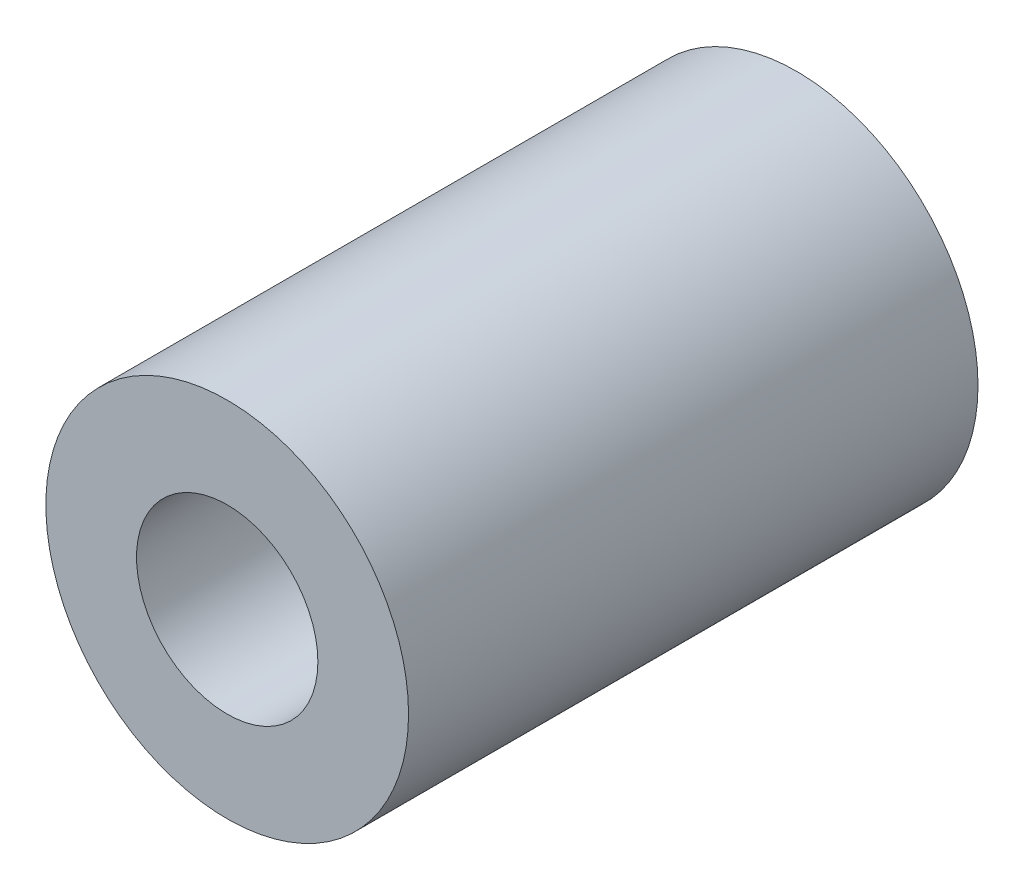
ISO-10303-21;
HEADER;
FILE_DESCRIPTION(('STEP AP214'),'2;1');
FILE_NAME('part.step','',(''),(''),'','','');
FILE_SCHEMA(('AUTOMOTIVE_DESIGN { 1 0 10303 214 1 1 1 1 }'));
ENDSEC;
DATA;
#1=APPLICATION_CONTEXT('core data for automotive mechanical design processes');
#2=APPLICATION_PROTOCOL_DEFINITION('international standard','automotive_design',2000,#1);
#3=PRODUCT_CONTEXT('',#1,'mechanical');
#4=PRODUCT('Part','Part','',(#3));
#5=PRODUCT_RELATED_PRODUCT_CATEGORY('part','',(#4));
#6=PRODUCT_DEFINITION_FORMATION('','',#4);
#7=PRODUCT_DEFINITION_CONTEXT('part definition',#1,'design');
#8=PRODUCT_DEFINITION('design','',#6,#7);
#9=PRODUCT_DEFINITION_SHAPE('','',#8);
#10=(LENGTH_UNIT() NAMED_UNIT(*) SI_UNIT(.MILLI.,.METRE.));
#11=(NAMED_UNIT(*) PLANE_ANGLE_UNIT() SI_UNIT($,.RADIAN.));
#12=(NAMED_UNIT(*) SI_UNIT($,.STERADIAN.) SOLID_ANGLE_UNIT());
#13=UNCERTAINTY_MEASURE_WITH_UNIT(LENGTH_MEASURE(1.E-05),#10,'distance_accuracy_value','');
#14=(GEOMETRIC_REPRESENTATION_CONTEXT(3) GLOBAL_UNCERTAINTY_ASSIGNED_CONTEXT((#13)) GLOBAL_UNIT_ASSIGNED_CONTEXT((#10,
#11,#12)) REPRESENTATION_CONTEXT('',''));
#15=CARTESIAN_POINT('',(0.,0.,0.));
#16=DIRECTION('',(0.,0.,1.));
#17=DIRECTION('',(1.,0.,0.));
#18=AXIS2_PLACEMENT_3D('',#15,#16,#17);
#19=CARTESIAN_POINT('',(0.,0.,15.7));
#20=DIRECTION('',(0.,0.,-1.));
#21=DIRECTION('',(-1.,0.,0.));
#22=AXIS2_PLACEMENT_3D('',#19,#20,#21);
#23=CYLINDRICAL_SURFACE('',#22,5.);
#24=CARTESIAN_POINT('',(0.,0.,15.7));
#25=DIRECTION('',(0.,0.,1.));
#26=DIRECTION('',(1.,0.,0.));
#27=AXIS2_PLACEMENT_3D('',#24,#25,#26);
#28=CIRCLE('',#27,5.);
#29=CARTESIAN_POINT('',(5.,0.,15.7));
#30=VERTEX_POINT('',#29);
#31=EDGE_CURVE('E10',#30,#30,#28,.T.);
#32=ORIENTED_EDGE('',*,*,#31,.F.);
#33=EDGE_LOOP('',(#32));
#34=FACE_BOUND('',#33,.T.);
#35=CARTESIAN_POINT('',(0.,0.,0.));
#36=DIRECTION('',(0.,0.,1.));
#37=DIRECTION('',(1.,0.,0.));
#38=AXIS2_PLACEMENT_3D('',#35,#36,#37);
#39=CIRCLE('',#38,5.);
#40=CARTESIAN_POINT('',(5.,0.,0.));
#41=VERTEX_POINT('',#40);
#42=EDGE_CURVE('E36',#41,#41,#39,.T.);
#43=ORIENTED_EDGE('',*,*,#42,.T.);
#44=EDGE_LOOP('',(#43));
#45=FACE_BOUND('',#44,.T.);
#46=ADVANCED_FACE('F33',(#34,#45),#23,.T.);
#47=CARTESIAN_POINT('',(0.,0.,15.7));
#48=DIRECTION('',(0.,0.,1.));
#49=DIRECTION('',(1.,0.,0.));
#50=AXIS2_PLACEMENT_3D('',#47,#48,#49);
#51=PLANE('',#50);
#52=CARTESIAN_POINT('',(0.,0.,15.7));
#53=DIRECTION('',(0.,0.,1.));
#54=DIRECTION('',(1.,0.,0.));
#55=AXIS2_PLACEMENT_3D('',#52,#53,#54);
#56=CIRCLE('',#55,2.5);
#57=CARTESIAN_POINT('',(2.5,0.,15.7));
#58=VERTEX_POINT('',#57);
#59=EDGE_CURVE('E47',#58,#58,#56,.T.);
#60=ORIENTED_EDGE('',*,*,#59,.F.);
#61=EDGE_LOOP('',(#60));
#62=FACE_BOUND('',#61,.T.);
#63=ORIENTED_EDGE('',*,*,#31,.T.);
#64=EDGE_LOOP('',(#63));
#65=FACE_BOUND('',#64,.T.);
#66=ADVANCED_FACE('F53',(#62,#65),#51,.T.);
#67=CARTESIAN_POINT('',(0.,0.,0.));
#68=DIRECTION('',(0.,0.,1.));
#69=DIRECTION('',(1.,0.,0.));
#70=AXIS2_PLACEMENT_3D('',#67,#68,#69);
#71=PLANE('',#70);
#72=CARTESIAN_POINT('',(0.,0.,0.));
#73=DIRECTION('',(0.,0.,1.));
#74=DIRECTION('',(1.,0.,0.));
#75=AXIS2_PLACEMENT_3D('',#72,#73,#74);
#76=CIRCLE('',#75,2.5);
#77=CARTESIAN_POINT('',(2.5,0.,0.));
#78=VERTEX_POINT('',#77);
#79=EDGE_CURVE('E43',#78,#78,#76,.T.);
#80=ORIENTED_EDGE('',*,*,#79,.T.);
#81=EDGE_LOOP('',(#80));
#82=FACE_BOUND('',#81,.T.);
#83=ORIENTED_EDGE('',*,*,#42,.F.);
#84=EDGE_LOOP('',(#83));
#85=FACE_BOUND('',#84,.T.);
#86=ADVANCED_FACE('F55',(#82,#85),#71,.F.);
#87=CARTESIAN_POINT('',(0.,0.,15.7));
#88=DIRECTION('',(0.,0.,1.));
#89=DIRECTION('',(1.,0.,0.));
#90=AXIS2_PLACEMENT_3D('',#87,#88,#89);
#91=CYLINDRICAL_SURFACE('',#90,2.5);
#92=ORIENTED_EDGE('',*,*,#79,.F.);
#93=EDGE_LOOP('',(#92));
#94=FACE_BOUND('',#93,.T.);
#95=ORIENTED_EDGE('',*,*,#59,.T.);
#96=EDGE_LOOP('',(#95));
#97=FACE_BOUND('',#96,.T.);
#98=ADVANCED_FACE('F51',(#94,#97),#91,.F.);
#99=CLOSED_SHELL('',(#46,#66,#86,#98));
#100=MANIFOLD_SOLID_BREP('B2',#99);
#101=ADVANCED_BREP_SHAPE_REPRESENTATION('',(#18,#100),#14);
#102=SHAPE_DEFINITION_REPRESENTATION(#9,#101);
ENDSEC;
END-ISO-10303-21;
